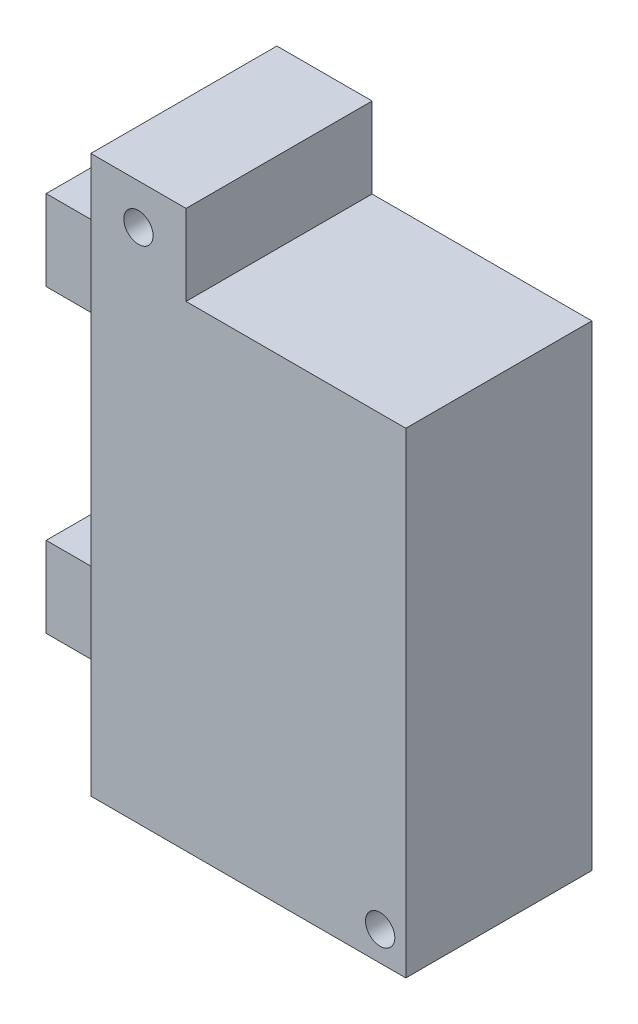
ISO-10303-21;
HEADER;
FILE_DESCRIPTION(('STEP AP214'),'2;1');
FILE_NAME('part.step','',(''),(''),'','','');
FILE_SCHEMA(('AUTOMOTIVE_DESIGN { 1 0 10303 214 1 1 1 1 }'));
ENDSEC;
DATA;
#1=APPLICATION_CONTEXT('core data for automotive mechanical design processes');
#2=APPLICATION_PROTOCOL_DEFINITION('international standard','automotive_design',2000,#1);
#3=PRODUCT_CONTEXT('',#1,'mechanical');
#4=PRODUCT('Part','Part','',(#3));
#5=PRODUCT_RELATED_PRODUCT_CATEGORY('part','',(#4));
#6=PRODUCT_DEFINITION_FORMATION('','',#4);
#7=PRODUCT_DEFINITION_CONTEXT('part definition',#1,'design');
#8=PRODUCT_DEFINITION('design','',#6,#7);
#9=PRODUCT_DEFINITION_SHAPE('','',#8);
#10=(LENGTH_UNIT() NAMED_UNIT(*) SI_UNIT(.MILLI.,.METRE.));
#11=(NAMED_UNIT(*) PLANE_ANGLE_UNIT() SI_UNIT($,.RADIAN.));
#12=(NAMED_UNIT(*) SI_UNIT($,.STERADIAN.) SOLID_ANGLE_UNIT());
#13=UNCERTAINTY_MEASURE_WITH_UNIT(LENGTH_MEASURE(1.E-05),#10,'distance_accuracy_value','');
#14=(GEOMETRIC_REPRESENTATION_CONTEXT(3) GLOBAL_UNCERTAINTY_ASSIGNED_CONTEXT((#13)) GLOBAL_UNIT_ASSIGNED_CONTEXT((#10,
#11,#12)) REPRESENTATION_CONTEXT('',''));
#15=CARTESIAN_POINT('',(0.,0.,0.));
#16=DIRECTION('',(0.,0.,1.));
#17=DIRECTION('',(1.,0.,0.));
#18=AXIS2_PLACEMENT_3D('',#15,#16,#17);
#19=CARTESIAN_POINT('',(0.,65.,12.7));
#20=DIRECTION('',(1.,0.,0.));
#21=DIRECTION('',(0.,0.,-1.));
#22=AXIS2_PLACEMENT_3D('',#19,#20,#21);
#23=PLANE('',#22);
#24=DIRECTION('',(0.,0.,-1.));
#25=VECTOR('',#24,1.);
#26=CARTESIAN_POINT('',(0.,23.,8.5));
#27=LINE('',#26,#25);
#28=CARTESIAN_POINT('',(0.,23.,8.5));
#29=VERTEX_POINT('',#28);
#30=CARTESIAN_POINT('',(0.,23.,-8.5));
#31=VERTEX_POINT('',#30);
#32=EDGE_CURVE('E48',#29,#31,#27,.T.);
#33=ORIENTED_EDGE('',*,*,#32,.F.);
#34=DIRECTION('',(0.,1.,0.));
#35=VECTOR('',#34,1.);
#36=CARTESIAN_POINT('',(0.,12.,8.5));
#37=LINE('',#36,#35);
#38=CARTESIAN_POINT('',(0.,12.,8.5));
#39=VERTEX_POINT('',#38);
#40=EDGE_CURVE('E53',#39,#29,#37,.T.);
#41=ORIENTED_EDGE('',*,*,#40,.F.);
#42=DIRECTION('',(0.,0.,-1.));
#43=VECTOR('',#42,1.);
#44=CARTESIAN_POINT('',(0.,12.,8.5));
#45=LINE('',#44,#43);
#46=CARTESIAN_POINT('',(0.,12.,-8.5));
#47=VERTEX_POINT('',#46);
#48=EDGE_CURVE('E153',#39,#47,#45,.T.);
#49=ORIENTED_EDGE('',*,*,#48,.T.);
#50=DIRECTION('',(0.,1.,0.));
#51=VECTOR('',#50,1.);
#52=CARTESIAN_POINT('',(0.,12.,-8.5));
#53=LINE('',#52,#51);
#54=EDGE_CURVE('E157',#47,#31,#53,.T.);
#55=ORIENTED_EDGE('',*,*,#54,.T.);
#56=EDGE_LOOP('',(#33,#41,#49,#55));
#57=FACE_BOUND('',#56,.T.);
#58=DIRECTION('',(0.,-1.,0.));
#59=VECTOR('',#58,1.);
#60=CARTESIAN_POINT('',(0.,65.,-12.7));
#61=LINE('',#60,#59);
#62=CARTESIAN_POINT('',(0.,76.,-12.7));
#63=VERTEX_POINT('',#62);
#64=CARTESIAN_POINT('',(0.,0.,-12.7));
#65=VERTEX_POINT('',#64);
#66=EDGE_CURVE('E215',#63,#65,#61,.T.);
#67=ORIENTED_EDGE('',*,*,#66,.T.);
#68=DIRECTION('',(0.,0.,-1.));
#69=VECTOR('',#68,1.);
#70=CARTESIAN_POINT('',(0.,0.,12.7));
#71=LINE('',#70,#69);
#72=CARTESIAN_POINT('',(0.,0.,12.7));
#73=VERTEX_POINT('',#72);
#74=EDGE_CURVE('E11',#73,#65,#71,.T.);
#75=ORIENTED_EDGE('',*,*,#74,.F.);
#76=DIRECTION('',(0.,-1.,0.));
#77=VECTOR('',#76,1.);
#78=CARTESIAN_POINT('',(0.,0.,12.7));
#79=LINE('',#78,#77);
#80=CARTESIAN_POINT('',(0.,76.,12.7));
#81=VERTEX_POINT('',#80);
#82=EDGE_CURVE('E211',#81,#73,#79,.T.);
#83=ORIENTED_EDGE('',*,*,#82,.F.);
#84=DIRECTION('',(0.,0.,-1.));
#85=VECTOR('',#84,1.);
#86=CARTESIAN_POINT('',(0.,76.,12.7));
#87=LINE('',#86,#85);
#88=EDGE_CURVE('E226',#81,#63,#87,.T.);
#89=ORIENTED_EDGE('',*,*,#88,.T.);
#90=EDGE_LOOP('',(#67,#75,#83,#89));
#91=FACE_BOUND('',#90,.T.);
#92=DIRECTION('',(0.,1.,0.));
#93=VECTOR('',#92,1.);
#94=CARTESIAN_POINT('',(0.,64.,8.5));
#95=LINE('',#94,#93);
#96=CARTESIAN_POINT('',(0.,53.,8.5));
#97=VERTEX_POINT('',#96);
#98=CARTESIAN_POINT('',(0.,64.,8.5));
#99=VERTEX_POINT('',#98);
#100=EDGE_CURVE('E170',#97,#99,#95,.T.);
#101=ORIENTED_EDGE('',*,*,#100,.F.);
#102=DIRECTION('',(0.,0.,-1.));
#103=VECTOR('',#102,1.);
#104=CARTESIAN_POINT('',(0.,53.,8.5));
#105=LINE('',#104,#103);
#106=CARTESIAN_POINT('',(0.,53.,-8.5));
#107=VERTEX_POINT('',#106);
#108=EDGE_CURVE('E180',#97,#107,#105,.T.);
#109=ORIENTED_EDGE('',*,*,#108,.T.);
#110=DIRECTION('',(0.,1.,0.));
#111=VECTOR('',#110,1.);
#112=CARTESIAN_POINT('',(0.,64.,-8.5));
#113=LINE('',#112,#111);
#114=CARTESIAN_POINT('',(0.,64.,-8.5));
#115=VERTEX_POINT('',#114);
#116=EDGE_CURVE('E169',#107,#115,#113,.T.);
#117=ORIENTED_EDGE('',*,*,#116,.T.);
#118=DIRECTION('',(0.,0.,-1.));
#119=VECTOR('',#118,1.);
#120=CARTESIAN_POINT('',(0.,64.,8.5));
#121=LINE('',#120,#119);
#122=EDGE_CURVE('E196',#99,#115,#121,.T.);
#123=ORIENTED_EDGE('',*,*,#122,.F.);
#124=EDGE_LOOP('',(#101,#109,#117,#123));
#125=FACE_BOUND('',#124,.T.);
#126=ADVANCED_FACE('F33',(#57,#91,#125),#23,.F.);
#127=CARTESIAN_POINT('',(0.,0.,12.7));
#128=DIRECTION('',(0.,0.,-1.));
#129=DIRECTION('',(-1.,0.,0.));
#130=AXIS2_PLACEMENT_3D('',#127,#128,#129);
#131=PLANE('',#130);
#132=ORIENTED_EDGE('',*,*,#82,.T.);
#133=DIRECTION('',(1.,0.,0.));
#134=VECTOR('',#133,1.);
#135=CARTESIAN_POINT('',(0.,0.,12.7));
#136=LINE('',#135,#134);
#137=CARTESIAN_POINT('',(43.,0.,12.7));
#138=VERTEX_POINT('',#137);
#139=EDGE_CURVE('E214',#73,#138,#136,.T.);
#140=ORIENTED_EDGE('',*,*,#139,.T.);
#141=DIRECTION('',(0.,1.,0.));
#142=VECTOR('',#141,1.);
#143=CARTESIAN_POINT('',(43.,0.,12.7));
#144=LINE('',#143,#142);
#145=CARTESIAN_POINT('',(43.,65.,12.7));
#146=VERTEX_POINT('',#145);
#147=EDGE_CURVE('E217',#138,#146,#144,.T.);
#148=ORIENTED_EDGE('',*,*,#147,.T.);
#149=DIRECTION('',(-1.,0.,0.));
#150=VECTOR('',#149,1.);
#151=CARTESIAN_POINT('',(13.,65.,12.7));
#152=LINE('',#151,#150);
#153=CARTESIAN_POINT('',(13.,65.,12.7));
#154=VERTEX_POINT('',#153);
#155=EDGE_CURVE('E219',#146,#154,#152,.T.);
#156=ORIENTED_EDGE('',*,*,#155,.T.);
#157=DIRECTION('',(0.,1.,0.));
#158=VECTOR('',#157,1.);
#159=CARTESIAN_POINT('',(13.,65.,12.7));
#160=LINE('',#159,#158);
#161=CARTESIAN_POINT('',(13.,76.,12.7));
#162=VERTEX_POINT('',#161);
#163=EDGE_CURVE('E221',#154,#162,#160,.T.);
#164=ORIENTED_EDGE('',*,*,#163,.T.);
#165=DIRECTION('',(-1.,0.,0.));
#166=VECTOR('',#165,1.);
#167=CARTESIAN_POINT('',(0.,76.,12.7));
#168=LINE('',#167,#166);
#169=EDGE_CURVE('E223',#162,#81,#168,.T.);
#170=ORIENTED_EDGE('',*,*,#169,.T.);
#171=EDGE_LOOP('',(#132,#140,#148,#156,#164,#170));
#172=FACE_BOUND('',#171,.T.);
#173=CARTESIAN_POINT('',(39.5,4.,12.7));
#174=DIRECTION('',(0.,0.,1.));
#175=DIRECTION('',(1.,0.,0.));
#176=AXIS2_PLACEMENT_3D('',#173,#174,#175);
#177=CIRCLE('',#176,2.);
#178=CARTESIAN_POINT('',(41.5,4.,12.7));
#179=VERTEX_POINT('',#178);
#180=EDGE_CURVE('E205',#179,#179,#177,.T.);
#181=ORIENTED_EDGE('',*,*,#180,.F.);
#182=EDGE_LOOP('',(#181));
#183=FACE_BOUND('',#182,.T.);
#184=CARTESIAN_POINT('',(6.5,70.5,12.7));
#185=DIRECTION('',(0.,0.,1.));
#186=DIRECTION('',(1.,0.,0.));
#187=AXIS2_PLACEMENT_3D('',#184,#185,#186);
#188=CIRCLE('',#187,2.);
#189=CARTESIAN_POINT('',(8.5,70.5,12.7));
#190=VERTEX_POINT('',#189);
#191=EDGE_CURVE('E199',#190,#190,#188,.T.);
#192=ORIENTED_EDGE('',*,*,#191,.F.);
#193=EDGE_LOOP('',(#192));
#194=FACE_BOUND('',#193,.T.);
#195=ADVANCED_FACE('F273',(#172,#183,#194),#131,.F.);
#196=CARTESIAN_POINT('',(0.,0.,-12.7));
#197=DIRECTION('',(0.,0.,-1.));
#198=DIRECTION('',(-1.,0.,0.));
#199=AXIS2_PLACEMENT_3D('',#196,#197,#198);
#200=PLANE('',#199);
#201=CARTESIAN_POINT('',(39.5,4.,-12.7));
#202=DIRECTION('',(0.,0.,1.));
#203=DIRECTION('',(1.,0.,0.));
#204=AXIS2_PLACEMENT_3D('',#201,#202,#203);
#205=CIRCLE('',#204,2.);
#206=CARTESIAN_POINT('',(41.5,4.,-12.7));
#207=VERTEX_POINT('',#206);
#208=EDGE_CURVE('E202',#207,#207,#205,.T.);
#209=ORIENTED_EDGE('',*,*,#208,.T.);
#210=EDGE_LOOP('',(#209));
#211=FACE_BOUND('',#210,.T.);
#212=DIRECTION('',(1.,0.,0.));
#213=VECTOR('',#212,1.);
#214=CARTESIAN_POINT('',(0.,0.,-12.7));
#215=LINE('',#214,#213);
#216=CARTESIAN_POINT('',(43.,0.,-12.7));
#217=VERTEX_POINT('',#216);
#218=EDGE_CURVE('E208',#65,#217,#215,.T.);
#219=ORIENTED_EDGE('',*,*,#218,.F.);
#220=ORIENTED_EDGE('',*,*,#66,.F.);
#221=DIRECTION('',(-1.,0.,0.));
#222=VECTOR('',#221,1.);
#223=CARTESIAN_POINT('',(0.,76.,-12.7));
#224=LINE('',#223,#222);
#225=CARTESIAN_POINT('',(13.,76.,-12.7));
#226=VERTEX_POINT('',#225);
#227=EDGE_CURVE('E234',#226,#63,#224,.T.);
#228=ORIENTED_EDGE('',*,*,#227,.F.);
#229=DIRECTION('',(0.,1.,0.));
#230=VECTOR('',#229,1.);
#231=CARTESIAN_POINT('',(13.,65.,-12.7));
#232=LINE('',#231,#230);
#233=CARTESIAN_POINT('',(13.,65.,-12.7));
#234=VERTEX_POINT('',#233);
#235=EDGE_CURVE('E232',#234,#226,#232,.T.);
#236=ORIENTED_EDGE('',*,*,#235,.F.);
#237=DIRECTION('',(-1.,0.,0.));
#238=VECTOR('',#237,1.);
#239=CARTESIAN_POINT('',(13.,65.,-12.7));
#240=LINE('',#239,#238);
#241=CARTESIAN_POINT('',(43.,65.,-12.7));
#242=VERTEX_POINT('',#241);
#243=EDGE_CURVE('E230',#242,#234,#240,.T.);
#244=ORIENTED_EDGE('',*,*,#243,.F.);
#245=DIRECTION('',(0.,1.,0.));
#246=VECTOR('',#245,1.);
#247=CARTESIAN_POINT('',(43.,0.,-12.7));
#248=LINE('',#247,#246);
#249=EDGE_CURVE('E228',#217,#242,#248,.T.);
#250=ORIENTED_EDGE('',*,*,#249,.F.);
#251=EDGE_LOOP('',(#219,#220,#228,#236,#244,#250));
#252=FACE_BOUND('',#251,.T.);
#253=CARTESIAN_POINT('',(6.5,70.5,-12.7));
#254=DIRECTION('',(0.,0.,1.));
#255=DIRECTION('',(1.,0.,0.));
#256=AXIS2_PLACEMENT_3D('',#253,#254,#255);
#257=CIRCLE('',#256,2.);
#258=CARTESIAN_POINT('',(8.5,70.5,-12.7));
#259=VERTEX_POINT('',#258);
#260=EDGE_CURVE('E198',#259,#259,#257,.T.);
#261=ORIENTED_EDGE('',*,*,#260,.T.);
#262=EDGE_LOOP('',(#261));
#263=FACE_BOUND('',#262,.T.);
#264=ADVANCED_FACE('F258',(#211,#252,#263),#200,.T.);
#265=CARTESIAN_POINT('',(0.,0.,12.7));
#266=DIRECTION('',(0.,1.,0.));
#267=DIRECTION('',(0.,0.,1.));
#268=AXIS2_PLACEMENT_3D('',#265,#266,#267);
#269=PLANE('',#268);
#270=ORIENTED_EDGE('',*,*,#218,.T.);
#271=DIRECTION('',(0.,0.,-1.));
#272=VECTOR('',#271,1.);
#273=CARTESIAN_POINT('',(43.,0.,12.7));
#274=LINE('',#273,#272);
#275=EDGE_CURVE('E41',#138,#217,#274,.T.);
#276=ORIENTED_EDGE('',*,*,#275,.F.);
#277=ORIENTED_EDGE('',*,*,#139,.F.);
#278=ORIENTED_EDGE('',*,*,#74,.T.);
#279=EDGE_LOOP('',(#270,#276,#277,#278));
#280=FACE_BOUND('',#279,.T.);
#281=ADVANCED_FACE('F35',(#280),#269,.F.);
#282=CARTESIAN_POINT('',(43.,0.,12.7));
#283=DIRECTION('',(-1.,0.,0.));
#284=DIRECTION('',(0.,0.,1.));
#285=AXIS2_PLACEMENT_3D('',#282,#283,#284);
#286=PLANE('',#285);
#287=ORIENTED_EDGE('',*,*,#249,.T.);
#288=DIRECTION('',(0.,0.,-1.));
#289=VECTOR('',#288,1.);
#290=CARTESIAN_POINT('',(43.,65.,12.7));
#291=LINE('',#290,#289);
#292=EDGE_CURVE('E245',#146,#242,#291,.T.);
#293=ORIENTED_EDGE('',*,*,#292,.F.);
#294=ORIENTED_EDGE('',*,*,#147,.F.);
#295=ORIENTED_EDGE('',*,*,#275,.T.);
#296=EDGE_LOOP('',(#287,#293,#294,#295));
#297=FACE_BOUND('',#296,.T.);
#298=ADVANCED_FACE('F252',(#297),#286,.F.);
#299=CARTESIAN_POINT('',(13.,65.,12.7));
#300=DIRECTION('',(0.,-1.,0.));
#301=DIRECTION('',(0.,0.,-1.));
#302=AXIS2_PLACEMENT_3D('',#299,#300,#301);
#303=PLANE('',#302);
#304=ORIENTED_EDGE('',*,*,#243,.T.);
#305=DIRECTION('',(0.,0.,-1.));
#306=VECTOR('',#305,1.);
#307=CARTESIAN_POINT('',(13.,65.,12.7));
#308=LINE('',#307,#306);
#309=EDGE_CURVE('E242',#154,#234,#308,.T.);
#310=ORIENTED_EDGE('',*,*,#309,.F.);
#311=ORIENTED_EDGE('',*,*,#155,.F.);
#312=ORIENTED_EDGE('',*,*,#292,.T.);
#313=EDGE_LOOP('',(#304,#310,#311,#312));
#314=FACE_BOUND('',#313,.T.);
#315=ADVANCED_FACE('F265',(#314),#303,.F.);
#316=CARTESIAN_POINT('',(13.,65.,12.7));
#317=DIRECTION('',(-1.,0.,0.));
#318=DIRECTION('',(0.,0.,1.));
#319=AXIS2_PLACEMENT_3D('',#316,#317,#318);
#320=PLANE('',#319);
#321=ORIENTED_EDGE('',*,*,#235,.T.);
#322=DIRECTION('',(0.,0.,-1.));
#323=VECTOR('',#322,1.);
#324=CARTESIAN_POINT('',(13.,76.,12.7));
#325=LINE('',#324,#323);
#326=EDGE_CURVE('E239',#162,#226,#325,.T.);
#327=ORIENTED_EDGE('',*,*,#326,.F.);
#328=ORIENTED_EDGE('',*,*,#163,.F.);
#329=ORIENTED_EDGE('',*,*,#309,.T.);
#330=EDGE_LOOP('',(#321,#327,#328,#329));
#331=FACE_BOUND('',#330,.T.);
#332=ADVANCED_FACE('F269',(#331),#320,.F.);
#333=CARTESIAN_POINT('',(0.,76.,12.7));
#334=DIRECTION('',(0.,-1.,0.));
#335=DIRECTION('',(0.,0.,-1.));
#336=AXIS2_PLACEMENT_3D('',#333,#334,#335);
#337=PLANE('',#336);
#338=ORIENTED_EDGE('',*,*,#227,.T.);
#339=ORIENTED_EDGE('',*,*,#88,.F.);
#340=ORIENTED_EDGE('',*,*,#169,.F.);
#341=ORIENTED_EDGE('',*,*,#326,.T.);
#342=EDGE_LOOP('',(#338,#339,#340,#341));
#343=FACE_BOUND('',#342,.T.);
#344=ADVANCED_FACE('F280',(#343),#337,.F.);
#345=CARTESIAN_POINT('',(39.5,4.,12.7));
#346=DIRECTION('',(0.,0.,-1.));
#347=DIRECTION('',(-1.,0.,0.));
#348=AXIS2_PLACEMENT_3D('',#345,#346,#347);
#349=CYLINDRICAL_SURFACE('',#348,2.);
#350=ORIENTED_EDGE('',*,*,#180,.T.);
#351=EDGE_LOOP('',(#350));
#352=FACE_BOUND('',#351,.T.);
#353=ORIENTED_EDGE('',*,*,#208,.F.);
#354=EDGE_LOOP('',(#353));
#355=FACE_BOUND('',#354,.T.);
#356=ADVANCED_FACE('F282',(#352,#355),#349,.F.);
#357=CARTESIAN_POINT('',(6.5,70.5,12.7));
#358=DIRECTION('',(0.,0.,-1.));
#359=DIRECTION('',(-1.,0.,0.));
#360=AXIS2_PLACEMENT_3D('',#357,#358,#359);
#361=CYLINDRICAL_SURFACE('',#360,2.);
#362=ORIENTED_EDGE('',*,*,#191,.T.);
#363=EDGE_LOOP('',(#362));
#364=FACE_BOUND('',#363,.T.);
#365=ORIENTED_EDGE('',*,*,#260,.F.);
#366=EDGE_LOOP('',(#365));
#367=FACE_BOUND('',#366,.T.);
#368=ADVANCED_FACE('F288',(#364,#367),#361,.F.);
#369=CARTESIAN_POINT('',(0.,64.,8.5));
#370=DIRECTION('',(0.,-1.,0.));
#371=DIRECTION('',(0.,0.,-1.));
#372=AXIS2_PLACEMENT_3D('',#369,#370,#371);
#373=PLANE('',#372);
#374=DIRECTION('',(-1.,0.,0.));
#375=VECTOR('',#374,1.);
#376=CARTESIAN_POINT('',(0.,64.,-8.5));
#377=LINE('',#376,#375);
#378=CARTESIAN_POINT('',(-10.3,64.,-8.5));
#379=VERTEX_POINT('',#378);
#380=EDGE_CURVE('E183',#115,#379,#377,.T.);
#381=ORIENTED_EDGE('',*,*,#380,.T.);
#382=DIRECTION('',(0.,0.,-1.));
#383=VECTOR('',#382,1.);
#384=CARTESIAN_POINT('',(-10.3,64.,8.5));
#385=LINE('',#384,#383);
#386=CARTESIAN_POINT('',(-10.3,64.,8.5));
#387=VERTEX_POINT('',#386);
#388=EDGE_CURVE('E193',#387,#379,#385,.T.);
#389=ORIENTED_EDGE('',*,*,#388,.F.);
#390=DIRECTION('',(-1.,0.,0.));
#391=VECTOR('',#390,1.);
#392=CARTESIAN_POINT('',(0.,64.,8.5));
#393=LINE('',#392,#391);
#394=EDGE_CURVE('E173',#99,#387,#393,.T.);
#395=ORIENTED_EDGE('',*,*,#394,.F.);
#396=ORIENTED_EDGE('',*,*,#122,.T.);
#397=EDGE_LOOP('',(#381,#389,#395,#396));
#398=FACE_BOUND('',#397,.T.);
#399=ADVANCED_FACE('F304',(#398),#373,.F.);
#400=CARTESIAN_POINT('',(-10.3,64.,8.5));
#401=DIRECTION('',(1.,0.,0.));
#402=DIRECTION('',(0.,0.,-1.));
#403=AXIS2_PLACEMENT_3D('',#400,#401,#402);
#404=PLANE('',#403);
#405=CARTESIAN_POINT('',(-10.3,58.5,0.));
#406=DIRECTION('',(-1.,0.,0.));
#407=DIRECTION('',(0.,0.,1.));
#408=AXIS2_PLACEMENT_3D('',#405,#406,#407);
#409=CIRCLE('',#408,3.);
#410=CARTESIAN_POINT('',(-10.3,58.5,3.));
#411=VERTEX_POINT('',#410);
#412=EDGE_CURVE('E359',#411,#411,#409,.T.);
#413=ORIENTED_EDGE('',*,*,#412,.F.);
#414=EDGE_LOOP('',(#413));
#415=FACE_BOUND('',#414,.T.);
#416=DIRECTION('',(0.,-1.,0.));
#417=VECTOR('',#416,1.);
#418=CARTESIAN_POINT('',(-10.3,64.,-8.5));
#419=LINE('',#418,#417);
#420=CARTESIAN_POINT('',(-10.3,53.,-8.5));
#421=VERTEX_POINT('',#420);
#422=EDGE_CURVE('E185',#379,#421,#419,.T.);
#423=ORIENTED_EDGE('',*,*,#422,.T.);
#424=DIRECTION('',(0.,0.,-1.));
#425=VECTOR('',#424,1.);
#426=CARTESIAN_POINT('',(-10.3,53.,8.5));
#427=LINE('',#426,#425);
#428=CARTESIAN_POINT('',(-10.3,53.,8.5));
#429=VERTEX_POINT('',#428);
#430=EDGE_CURVE('E190',#429,#421,#427,.T.);
#431=ORIENTED_EDGE('',*,*,#430,.F.);
#432=DIRECTION('',(0.,-1.,0.));
#433=VECTOR('',#432,1.);
#434=CARTESIAN_POINT('',(-10.3,64.,8.5));
#435=LINE('',#434,#433);
#436=EDGE_CURVE('E176',#387,#429,#435,.T.);
#437=ORIENTED_EDGE('',*,*,#436,.F.);
#438=ORIENTED_EDGE('',*,*,#388,.T.);
#439=EDGE_LOOP('',(#423,#431,#437,#438));
#440=FACE_BOUND('',#439,.T.);
#441=ADVANCED_FACE('F308',(#415,#440),#404,.F.);
#442=CARTESIAN_POINT('',(0.,53.,8.5));
#443=DIRECTION('',(0.,1.,0.));
#444=DIRECTION('',(0.,0.,1.));
#445=AXIS2_PLACEMENT_3D('',#442,#443,#444);
#446=PLANE('',#445);
#447=DIRECTION('',(1.,0.,0.));
#448=VECTOR('',#447,1.);
#449=CARTESIAN_POINT('',(0.,53.,-8.5));
#450=LINE('',#449,#448);
#451=EDGE_CURVE('E174',#421,#107,#450,.T.);
#452=ORIENTED_EDGE('',*,*,#451,.T.);
#453=ORIENTED_EDGE('',*,*,#108,.F.);
#454=DIRECTION('',(1.,0.,0.));
#455=VECTOR('',#454,1.);
#456=CARTESIAN_POINT('',(0.,53.,8.5));
#457=LINE('',#456,#455);
#458=EDGE_CURVE('E178',#429,#97,#457,.T.);
#459=ORIENTED_EDGE('',*,*,#458,.F.);
#460=ORIENTED_EDGE('',*,*,#430,.T.);
#461=EDGE_LOOP('',(#452,#453,#459,#460));
#462=FACE_BOUND('',#461,.T.);
#463=ADVANCED_FACE('F312',(#462),#446,.F.);
#464=CARTESIAN_POINT('',(0.,0.,8.5));
#465=DIRECTION('',(0.,0.,-1.));
#466=DIRECTION('',(-1.,0.,0.));
#467=AXIS2_PLACEMENT_3D('',#464,#465,#466);
#468=PLANE('',#467);
#469=ORIENTED_EDGE('',*,*,#100,.T.);
#470=ORIENTED_EDGE('',*,*,#394,.T.);
#471=ORIENTED_EDGE('',*,*,#436,.T.);
#472=ORIENTED_EDGE('',*,*,#458,.T.);
#473=EDGE_LOOP('',(#469,#470,#471,#472));
#474=FACE_BOUND('',#473,.T.);
#475=ADVANCED_FACE('F316',(#474),#468,.F.);
#476=CARTESIAN_POINT('',(0.,0.,-8.5));
#477=DIRECTION('',(0.,0.,-1.));
#478=DIRECTION('',(-1.,0.,0.));
#479=AXIS2_PLACEMENT_3D('',#476,#477,#478);
#480=PLANE('',#479);
#481=ORIENTED_EDGE('',*,*,#116,.F.);
#482=ORIENTED_EDGE('',*,*,#451,.F.);
#483=ORIENTED_EDGE('',*,*,#422,.F.);
#484=ORIENTED_EDGE('',*,*,#380,.F.);
#485=EDGE_LOOP('',(#481,#482,#483,#484));
#486=FACE_BOUND('',#485,.T.);
#487=ADVANCED_FACE('F318',(#486),#480,.T.);
#488=CARTESIAN_POINT('',(0.,23.,8.5));
#489=DIRECTION('',(0.,-1.,0.));
#490=DIRECTION('',(0.,0.,-1.));
#491=AXIS2_PLACEMENT_3D('',#488,#489,#490);
#492=PLANE('',#491);
#493=DIRECTION('',(-1.,0.,0.));
#494=VECTOR('',#493,1.);
#495=CARTESIAN_POINT('',(0.,23.,-8.5));
#496=LINE('',#495,#494);
#497=CARTESIAN_POINT('',(-10.3,23.,-8.5));
#498=VERTEX_POINT('',#497);
#499=EDGE_CURVE('E143',#31,#498,#496,.T.);
#500=ORIENTED_EDGE('',*,*,#499,.T.);
#501=DIRECTION('',(0.,0.,-1.));
#502=VECTOR('',#501,1.);
#503=CARTESIAN_POINT('',(-10.3,23.,8.5));
#504=LINE('',#503,#502);
#505=CARTESIAN_POINT('',(-10.3,23.,8.5));
#506=VERTEX_POINT('',#505);
#507=EDGE_CURVE('E140',#506,#498,#504,.T.);
#508=ORIENTED_EDGE('',*,*,#507,.F.);
#509=DIRECTION('',(-1.,0.,0.));
#510=VECTOR('',#509,1.);
#511=CARTESIAN_POINT('',(0.,23.,8.5));
#512=LINE('',#511,#510);
#513=EDGE_CURVE('E131',#29,#506,#512,.T.);
#514=ORIENTED_EDGE('',*,*,#513,.F.);
#515=ORIENTED_EDGE('',*,*,#32,.T.);
#516=EDGE_LOOP('',(#500,#508,#514,#515));
#517=FACE_BOUND('',#516,.T.);
#518=ADVANCED_FACE('F141',(#517),#492,.F.);
#519=CARTESIAN_POINT('',(-10.3,12.,8.5));
#520=DIRECTION('',(1.,0.,0.));
#521=DIRECTION('',(0.,0.,-1.));
#522=AXIS2_PLACEMENT_3D('',#519,#520,#521);
#523=PLANE('',#522);
#524=CARTESIAN_POINT('',(-10.3,17.5,0.));
#525=DIRECTION('',(-1.,0.,0.));
#526=DIRECTION('',(0.,0.,1.));
#527=AXIS2_PLACEMENT_3D('',#524,#525,#526);
#528=CIRCLE('',#527,3.);
#529=CARTESIAN_POINT('',(-10.3,17.5,3.));
#530=VERTEX_POINT('',#529);
#531=EDGE_CURVE('E367',#530,#530,#528,.T.);
#532=ORIENTED_EDGE('',*,*,#531,.F.);
#533=EDGE_LOOP('',(#532));
#534=FACE_BOUND('',#533,.T.);
#535=DIRECTION('',(0.,-1.,0.));
#536=VECTOR('',#535,1.);
#537=CARTESIAN_POINT('',(-10.3,12.,-8.5));
#538=LINE('',#537,#536);
#539=CARTESIAN_POINT('',(-10.3,12.,-8.5));
#540=VERTEX_POINT('',#539);
#541=EDGE_CURVE('E161',#498,#540,#538,.T.);
#542=ORIENTED_EDGE('',*,*,#541,.T.);
#543=DIRECTION('',(0.,0.,-1.));
#544=VECTOR('',#543,1.);
#545=CARTESIAN_POINT('',(-10.3,12.,8.5));
#546=LINE('',#545,#544);
#547=CARTESIAN_POINT('',(-10.3,12.,8.5));
#548=VERTEX_POINT('',#547);
#549=EDGE_CURVE('E146',#548,#540,#546,.T.);
#550=ORIENTED_EDGE('',*,*,#549,.F.);
#551=DIRECTION('',(0.,-1.,0.));
#552=VECTOR('',#551,1.);
#553=CARTESIAN_POINT('',(-10.3,12.,8.5));
#554=LINE('',#553,#552);
#555=EDGE_CURVE('E135',#506,#548,#554,.T.);
#556=ORIENTED_EDGE('',*,*,#555,.F.);
#557=ORIENTED_EDGE('',*,*,#507,.T.);
#558=EDGE_LOOP('',(#542,#550,#556,#557));
#559=FACE_BOUND('',#558,.T.);
#560=ADVANCED_FACE('F148',(#534,#559),#523,.F.);
#561=CARTESIAN_POINT('',(0.,12.,8.5));
#562=DIRECTION('',(0.,1.,0.));
#563=DIRECTION('',(-1.,0.,0.));
#564=AXIS2_PLACEMENT_3D('',#561,#562,#563);
#565=PLANE('',#564);
#566=DIRECTION('',(1.,0.,0.));
#567=VECTOR('',#566,1.);
#568=CARTESIAN_POINT('',(0.,12.,-8.5));
#569=LINE('',#568,#567);
#570=EDGE_CURVE('E163',#540,#47,#569,.T.);
#571=ORIENTED_EDGE('',*,*,#570,.T.);
#572=ORIENTED_EDGE('',*,*,#48,.F.);
#573=DIRECTION('',(1.,0.,0.));
#574=VECTOR('',#573,1.);
#575=CARTESIAN_POINT('',(0.,12.,8.5));
#576=LINE('',#575,#574);
#577=EDGE_CURVE('E151',#548,#39,#576,.T.);
#578=ORIENTED_EDGE('',*,*,#577,.F.);
#579=ORIENTED_EDGE('',*,*,#549,.T.);
#580=EDGE_LOOP('',(#571,#572,#578,#579));
#581=FACE_BOUND('',#580,.T.);
#582=ADVANCED_FACE('F329',(#581),#565,.F.);
#583=CARTESIAN_POINT('',(0.,0.,8.5));
#584=DIRECTION('',(0.,0.,1.));
#585=DIRECTION('',(1.,0.,0.));
#586=AXIS2_PLACEMENT_3D('',#583,#584,#585);
#587=PLANE('',#586);
#588=ORIENTED_EDGE('',*,*,#40,.T.);
#589=ORIENTED_EDGE('',*,*,#513,.T.);
#590=ORIENTED_EDGE('',*,*,#555,.T.);
#591=ORIENTED_EDGE('',*,*,#577,.T.);
#592=EDGE_LOOP('',(#588,#589,#590,#591));
#593=FACE_BOUND('',#592,.T.);
#594=ADVANCED_FACE('F133',(#593),#587,.T.);
#595=CARTESIAN_POINT('',(0.,0.,-8.5));
#596=DIRECTION('',(0.,0.,1.));
#597=DIRECTION('',(1.,0.,0.));
#598=AXIS2_PLACEMENT_3D('',#595,#596,#597);
#599=PLANE('',#598);
#600=ORIENTED_EDGE('',*,*,#54,.F.);
#601=ORIENTED_EDGE('',*,*,#570,.F.);
#602=ORIENTED_EDGE('',*,*,#541,.F.);
#603=ORIENTED_EDGE('',*,*,#499,.F.);
#604=EDGE_LOOP('',(#600,#601,#602,#603));
#605=FACE_BOUND('',#604,.T.);
#606=ADVANCED_FACE('F334',(#605),#599,.F.);
#607=CARTESIAN_POINT('',(-0.799999999999993,17.5,0.));
#608=DIRECTION('',(-1.,0.,0.));
#609=DIRECTION('',(0.,0.,1.));
#610=AXIS2_PLACEMENT_3D('',#607,#608,#609);
#611=CYLINDRICAL_SURFACE('',#610,3.);
#612=CARTESIAN_POINT('',(-0.799999999999993,17.5,0.));
#613=DIRECTION('',(-1.,0.,0.));
#614=DIRECTION('',(0.,0.,1.));
#615=AXIS2_PLACEMENT_3D('',#612,#613,#614);
#616=CIRCLE('',#615,3.);
#617=CARTESIAN_POINT('',(-0.799999999999993,17.5,3.));
#618=VERTEX_POINT('',#617);
#619=EDGE_CURVE('E362',#618,#618,#616,.T.);
#620=ORIENTED_EDGE('',*,*,#619,.F.);
#621=EDGE_LOOP('',(#620));
#622=FACE_BOUND('',#621,.T.);
#623=ORIENTED_EDGE('',*,*,#531,.T.);
#624=EDGE_LOOP('',(#623));
#625=FACE_BOUND('',#624,.T.);
#626=ADVANCED_FACE('F337',(#622,#625),#611,.F.);
#627=CARTESIAN_POINT('',(-0.799999999999993,17.5,0.));
#628=DIRECTION('',(-1.,0.,0.));
#629=DIRECTION('',(0.,0.,1.));
#630=AXIS2_PLACEMENT_3D('',#627,#628,#629);
#631=PLANE('',#630);
#632=ORIENTED_EDGE('',*,*,#619,.T.);
#633=EDGE_LOOP('',(#632));
#634=FACE_BOUND('',#633,.T.);
#635=ADVANCED_FACE('F343',(#634),#631,.T.);
#636=CARTESIAN_POINT('',(-0.799999999999993,58.5,0.));
#637=DIRECTION('',(-1.,0.,0.));
#638=DIRECTION('',(0.,0.,1.));
#639=AXIS2_PLACEMENT_3D('',#636,#637,#638);
#640=CYLINDRICAL_SURFACE('',#639,3.);
#641=CARTESIAN_POINT('',(-0.799999999999993,58.5,0.));
#642=DIRECTION('',(-1.,0.,0.));
#643=DIRECTION('',(0.,0.,1.));
#644=AXIS2_PLACEMENT_3D('',#641,#642,#643);
#645=CIRCLE('',#644,3.);
#646=CARTESIAN_POINT('',(-0.799999999999993,58.5,3.));
#647=VERTEX_POINT('',#646);
#648=EDGE_CURVE('E159',#647,#647,#645,.T.);
#649=ORIENTED_EDGE('',*,*,#648,.F.);
#650=EDGE_LOOP('',(#649));
#651=FACE_BOUND('',#650,.T.);
#652=ORIENTED_EDGE('',*,*,#412,.T.);
#653=EDGE_LOOP('',(#652));
#654=FACE_BOUND('',#653,.T.);
#655=ADVANCED_FACE('F347',(#651,#654),#640,.F.);
#656=CARTESIAN_POINT('',(-0.799999999999993,58.5,0.));
#657=DIRECTION('',(-1.,0.,0.));
#658=DIRECTION('',(0.,0.,1.));
#659=AXIS2_PLACEMENT_3D('',#656,#657,#658);
#660=PLANE('',#659);
#661=ORIENTED_EDGE('',*,*,#648,.T.);
#662=EDGE_LOOP('',(#661));
#663=FACE_BOUND('',#662,.T.);
#664=ADVANCED_FACE('F351',(#663),#660,.T.);
#665=CLOSED_SHELL('',(#126,#195,#264,#281,#298,#315,#332,#344,#356,#368,#399,#441,#463,#475,
#487,#518,#560,#582,#594,#606,#626,#635,#655,#664));
#666=MANIFOLD_SOLID_BREP('B2',#665);
#667=ADVANCED_BREP_SHAPE_REPRESENTATION('',(#18,#666),#14);
#668=SHAPE_DEFINITION_REPRESENTATION(#9,#667);
ENDSEC;
END-ISO-10303-21;
